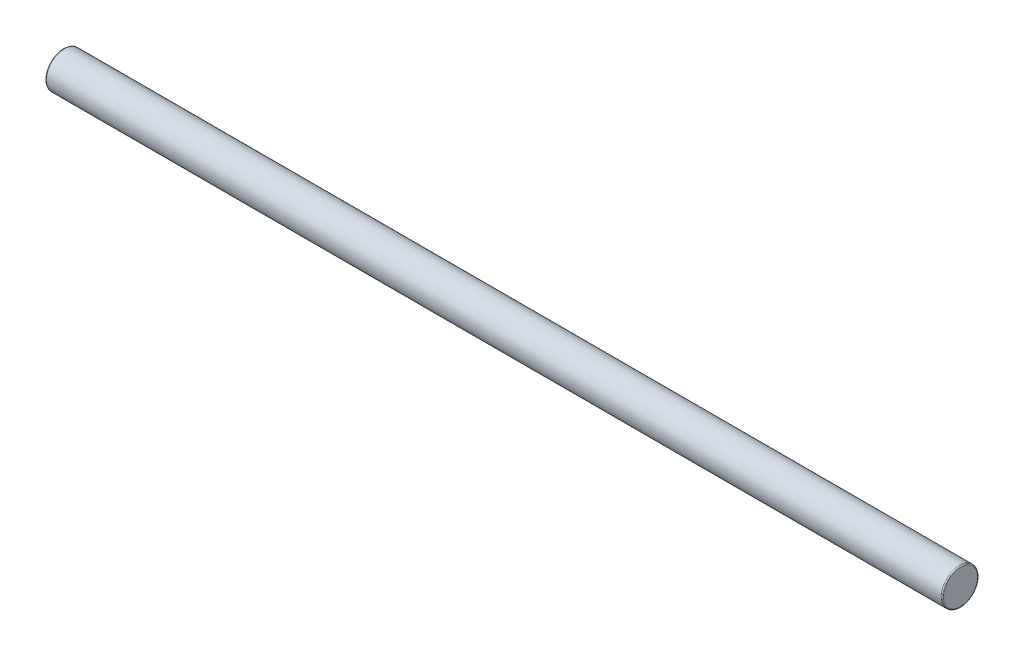
ISO-10303-21;
HEADER;
FILE_DESCRIPTION(('STEP AP214'),'2;1');
FILE_NAME('part.step','',(''),(''),'','','');
FILE_SCHEMA(('AUTOMOTIVE_DESIGN { 1 0 10303 214 1 1 1 1 }'));
ENDSEC;
DATA;
#1=APPLICATION_CONTEXT('core data for automotive mechanical design processes');
#2=APPLICATION_PROTOCOL_DEFINITION('international standard','automotive_design',2000,#1);
#3=PRODUCT_CONTEXT('',#1,'mechanical');
#4=PRODUCT('Part','Part','',(#3));
#5=PRODUCT_RELATED_PRODUCT_CATEGORY('part','',(#4));
#6=PRODUCT_DEFINITION_FORMATION('','',#4);
#7=PRODUCT_DEFINITION_CONTEXT('part definition',#1,'design');
#8=PRODUCT_DEFINITION('design','',#6,#7);
#9=PRODUCT_DEFINITION_SHAPE('','',#8);
#10=(LENGTH_UNIT() NAMED_UNIT(*) SI_UNIT(.MILLI.,.METRE.));
#11=(NAMED_UNIT(*) PLANE_ANGLE_UNIT() SI_UNIT($,.RADIAN.));
#12=(NAMED_UNIT(*) SI_UNIT($,.STERADIAN.) SOLID_ANGLE_UNIT());
#13=UNCERTAINTY_MEASURE_WITH_UNIT(LENGTH_MEASURE(1.E-05),#10,'distance_accuracy_value','');
#14=(GEOMETRIC_REPRESENTATION_CONTEXT(3) GLOBAL_UNCERTAINTY_ASSIGNED_CONTEXT((#13)) GLOBAL_UNIT_ASSIGNED_CONTEXT((#10,
#11,#12)) REPRESENTATION_CONTEXT('',''));
#15=CARTESIAN_POINT('',(0.,0.,0.));
#16=DIRECTION('',(0.,0.,1.));
#17=DIRECTION('',(1.,0.,0.));
#18=AXIS2_PLACEMENT_3D('',#15,#16,#17);
#19=CARTESIAN_POINT('',(18.796,0.,0.));
#20=DIRECTION('',(-1.,0.,0.));
#21=DIRECTION('',(0.,0.,1.));
#22=AXIS2_PLACEMENT_3D('',#19,#20,#21);
#23=CYLINDRICAL_SURFACE('',#22,0.380999999999999);
#24=CARTESIAN_POINT('',(0.0253999999999983,0.,0.));
#25=DIRECTION('',(1.,0.,0.));
#26=DIRECTION('',(0.,0.,-1.));
#27=AXIS2_PLACEMENT_3D('',#24,#25,#26);
#28=CIRCLE('',#27,0.380999999999999);
#29=CARTESIAN_POINT('',(0.0253999999999983,0.,-0.380999999999999));
#30=VERTEX_POINT('',#29);
#31=EDGE_CURVE('E45',#30,#30,#28,.T.);
#32=ORIENTED_EDGE('',*,*,#31,.T.);
#33=EDGE_LOOP('',(#32));
#34=FACE_BOUND('',#33,.T.);
#35=CARTESIAN_POINT('',(18.7706,0.,0.));
#36=DIRECTION('',(1.,0.,0.));
#37=DIRECTION('',(0.,0.,-1.));
#38=AXIS2_PLACEMENT_3D('',#35,#36,#37);
#39=CIRCLE('',#38,0.380999999999999);
#40=CARTESIAN_POINT('',(18.7706,0.,-0.380999999999999));
#41=VERTEX_POINT('',#40);
#42=EDGE_CURVE('E49',#41,#41,#39,.F.);
#43=ORIENTED_EDGE('',*,*,#42,.T.);
#44=EDGE_LOOP('',(#43));
#45=FACE_BOUND('',#44,.T.);
#46=ADVANCED_FACE('F32',(#34,#45),#23,.T.);
#47=CARTESIAN_POINT('',(18.796,0.,0.));
#48=DIRECTION('',(1.,0.,0.));
#49=DIRECTION('',(0.,0.,-1.));
#50=AXIS2_PLACEMENT_3D('',#47,#48,#49);
#51=PLANE('',#50);
#52=CARTESIAN_POINT('',(18.796,0.,0.));
#53=DIRECTION('',(1.,0.,0.));
#54=DIRECTION('',(0.,0.,-1.));
#55=AXIS2_PLACEMENT_3D('',#52,#53,#54);
#56=CIRCLE('',#55,0.355599999999999);
#57=CARTESIAN_POINT('',(18.796,0.,-0.355599999999999));
#58=VERTEX_POINT('',#57);
#59=EDGE_CURVE('E10',#58,#58,#56,.T.);
#60=ORIENTED_EDGE('',*,*,#59,.T.);
#61=EDGE_LOOP('',(#60));
#62=FACE_BOUND('',#61,.T.);
#63=ADVANCED_FACE('F65',(#62),#51,.T.);
#64=CARTESIAN_POINT('',(0.,0.,0.));
#65=DIRECTION('',(1.,0.,0.));
#66=DIRECTION('',(0.,0.,-1.));
#67=AXIS2_PLACEMENT_3D('',#64,#65,#66);
#68=PLANE('',#67);
#69=CARTESIAN_POINT('',(0.,0.,0.));
#70=DIRECTION('',(1.,0.,0.));
#71=DIRECTION('',(0.,0.,-1.));
#72=AXIS2_PLACEMENT_3D('',#69,#70,#71);
#73=CIRCLE('',#72,0.355599999999999);
#74=CARTESIAN_POINT('',(0.,0.,-0.355599999999999));
#75=VERTEX_POINT('',#74);
#76=EDGE_CURVE('E40',#75,#75,#73,.F.);
#77=ORIENTED_EDGE('',*,*,#76,.T.);
#78=EDGE_LOOP('',(#77));
#79=FACE_BOUND('',#78,.T.);
#80=ADVANCED_FACE('F62',(#79),#68,.F.);
#81=CARTESIAN_POINT('',(0.0253999999999983,0.,0.));
#82=DIRECTION('',(1.,0.,0.));
#83=DIRECTION('',(0.,0.,-1.));
#84=AXIS2_PLACEMENT_3D('',#81,#82,#83);
#85=TOROIDAL_SURFACE('',#84,0.355599999999999,0.0254);
#86=ORIENTED_EDGE('',*,*,#76,.F.);
#87=EDGE_LOOP('',(#86));
#88=FACE_BOUND('',#87,.T.);
#89=ORIENTED_EDGE('',*,*,#31,.F.);
#90=EDGE_LOOP('',(#89));
#91=FACE_BOUND('',#90,.T.);
#92=ADVANCED_FACE('F58',(#88,#91),#85,.T.);
#93=CARTESIAN_POINT('',(18.7706,0.,0.));
#94=DIRECTION('',(1.,0.,0.));
#95=DIRECTION('',(0.,0.,-1.));
#96=AXIS2_PLACEMENT_3D('',#93,#94,#95);
#97=TOROIDAL_SURFACE('',#96,0.355599999999999,0.0254);
#98=ORIENTED_EDGE('',*,*,#42,.F.);
#99=EDGE_LOOP('',(#98));
#100=FACE_BOUND('',#99,.T.);
#101=ORIENTED_EDGE('',*,*,#59,.F.);
#102=EDGE_LOOP('',(#101));
#103=FACE_BOUND('',#102,.T.);
#104=ADVANCED_FACE('F34',(#100,#103),#97,.T.);
#105=CLOSED_SHELL('',(#46,#63,#80,#92,#104));
#106=MANIFOLD_SOLID_BREP('B2',#105);
#107=ADVANCED_BREP_SHAPE_REPRESENTATION('',(#18,#106),#14);
#108=SHAPE_DEFINITION_REPRESENTATION(#9,#107);
ENDSEC;
END-ISO-10303-21;
